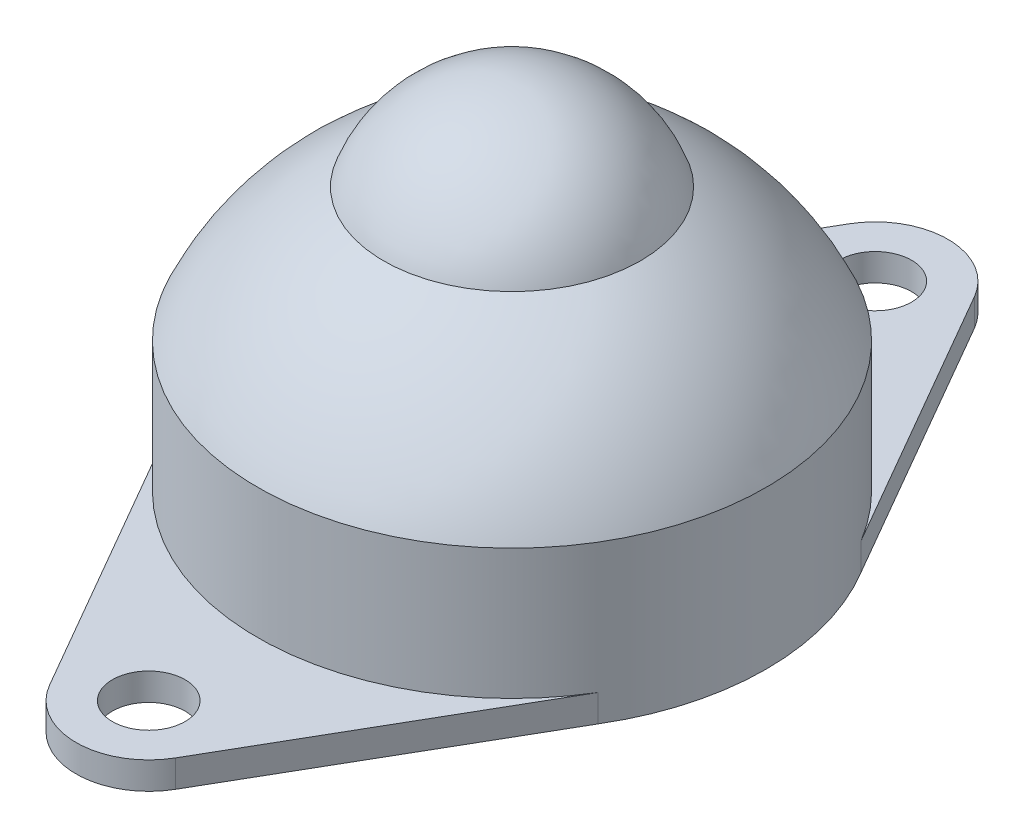
ISO-10303-21;
HEADER;
FILE_DESCRIPTION(('STEP AP214'),'2;1');
FILE_NAME('part.step','',(''),(''),'','','');
FILE_SCHEMA(('AUTOMOTIVE_DESIGN { 1 0 10303 214 1 1 1 1 }'));
ENDSEC;
DATA;
#1=APPLICATION_CONTEXT('core data for automotive mechanical design processes');
#2=APPLICATION_PROTOCOL_DEFINITION('international standard','automotive_design',2000,#1);
#3=PRODUCT_CONTEXT('',#1,'mechanical');
#4=PRODUCT('Part','Part','',(#3));
#5=PRODUCT_RELATED_PRODUCT_CATEGORY('part','',(#4));
#6=PRODUCT_DEFINITION_FORMATION('','',#4);
#7=PRODUCT_DEFINITION_CONTEXT('part definition',#1,'design');
#8=PRODUCT_DEFINITION('design','',#6,#7);
#9=PRODUCT_DEFINITION_SHAPE('','',#8);
#10=(LENGTH_UNIT() NAMED_UNIT(*) SI_UNIT(.MILLI.,.METRE.));
#11=(NAMED_UNIT(*) PLANE_ANGLE_UNIT() SI_UNIT($,.RADIAN.));
#12=(NAMED_UNIT(*) SI_UNIT($,.STERADIAN.) SOLID_ANGLE_UNIT());
#13=UNCERTAINTY_MEASURE_WITH_UNIT(LENGTH_MEASURE(1.E-05),#10,'distance_accuracy_value','');
#14=(GEOMETRIC_REPRESENTATION_CONTEXT(3) GLOBAL_UNCERTAINTY_ASSIGNED_CONTEXT((#13)) GLOBAL_UNIT_ASSIGNED_CONTEXT((#10,
#11,#12)) REPRESENTATION_CONTEXT('',''));
#15=CARTESIAN_POINT('',(0.,0.,0.));
#16=DIRECTION('',(0.,0.,1.));
#17=DIRECTION('',(1.,0.,0.));
#18=AXIS2_PLACEMENT_3D('',#15,#16,#17);
#19=CARTESIAN_POINT('',(0.,0.,0.));
#20=DIRECTION('',(0.,-1.,0.));
#21=DIRECTION('',(0.,0.,-1.));
#22=AXIS2_PLACEMENT_3D('',#19,#20,#21);
#23=CYLINDRICAL_SURFACE('',#22,14.);
#24=CARTESIAN_POINT('',(0.,8.66628605278543,0.));
#25=DIRECTION('',(0.,-1.,0.));
#26=DIRECTION('',(0.,0.,-1.));
#27=AXIS2_PLACEMENT_3D('',#24,#25,#26);
#28=CIRCLE('',#27,14.);
#29=CARTESIAN_POINT('',(0.,8.66628605278543,-14.));
#30=VERTEX_POINT('',#29);
#31=EDGE_CURVE('E184',#30,#30,#28,.T.);
#32=ORIENTED_EDGE('',*,*,#31,.T.);
#33=EDGE_LOOP('',(#32));
#34=FACE_BOUND('',#33,.T.);
#35=CARTESIAN_POINT('',(0.,1.5,0.));
#36=DIRECTION('',(0.,1.,0.));
#37=DIRECTION('',(0.,0.,1.));
#38=AXIS2_PLACEMENT_3D('',#35,#36,#37);
#39=CIRCLE('',#38,14.);
#40=CARTESIAN_POINT('',(-11.9808084921455,1.5,7.24294331570621));
#41=VERTEX_POINT('',#40);
#42=CARTESIAN_POINT('',(11.9808084921456,1.5,7.24294331570617));
#43=VERTEX_POINT('',#42);
#44=EDGE_CURVE('E12',#41,#43,#39,.T.);
#45=ORIENTED_EDGE('',*,*,#44,.T.);
#46=DIRECTION('',(0.,-1.,0.));
#47=VECTOR('',#46,1.);
#48=CARTESIAN_POINT('',(11.9808084921456,1.5,7.24294331570617));
#49=LINE('',#48,#47);
#50=CARTESIAN_POINT('',(11.9808084921456,0.,7.24294331570617));
#51=VERTEX_POINT('',#50);
#52=EDGE_CURVE('E195',#43,#51,#49,.T.);
#53=ORIENTED_EDGE('',*,*,#52,.T.);
#54=CARTESIAN_POINT('',(0.,0.,0.));
#55=DIRECTION('',(0.,-1.,0.));
#56=DIRECTION('',(0.,0.,-1.));
#57=AXIS2_PLACEMENT_3D('',#54,#55,#56);
#58=CIRCLE('',#57,14.);
#59=CARTESIAN_POINT('',(11.9808084921456,0.,-7.24294331570617));
#60=VERTEX_POINT('',#59);
#61=EDGE_CURVE('E178',#60,#51,#58,.T.);
#62=ORIENTED_EDGE('',*,*,#61,.F.);
#63=DIRECTION('',(0.,-1.,0.));
#64=VECTOR('',#63,1.);
#65=CARTESIAN_POINT('',(11.9808084921456,1.5,-7.24294331570617));
#66=LINE('',#65,#64);
#67=CARTESIAN_POINT('',(11.9808084921455,1.5,-7.24294331570621));
#68=VERTEX_POINT('',#67);
#69=EDGE_CURVE('E192',#68,#60,#66,.T.);
#70=ORIENTED_EDGE('',*,*,#69,.F.);
#71=CARTESIAN_POINT('',(-11.9808084921456,1.5,-7.24294331570617));
#72=VERTEX_POINT('',#71);
#73=EDGE_CURVE('E93',#68,#72,#39,.T.);
#74=ORIENTED_EDGE('',*,*,#73,.T.);
#75=DIRECTION('',(0.,-1.,0.));
#76=VECTOR('',#75,1.);
#77=CARTESIAN_POINT('',(-11.9808084921456,1.5,-7.24294331570617));
#78=LINE('',#77,#76);
#79=CARTESIAN_POINT('',(-11.9808084921456,0.,-7.24294331570617));
#80=VERTEX_POINT('',#79);
#81=EDGE_CURVE('E160',#72,#80,#78,.T.);
#82=ORIENTED_EDGE('',*,*,#81,.T.);
#83=CARTESIAN_POINT('',(-11.9808084921455,0.,7.24294331570629));
#84=VERTEX_POINT('',#83);
#85=EDGE_CURVE('E175',#84,#80,#58,.T.);
#86=ORIENTED_EDGE('',*,*,#85,.F.);
#87=DIRECTION('',(0.,-1.,0.));
#88=VECTOR('',#87,1.);
#89=CARTESIAN_POINT('',(-11.9808084921456,1.5,7.24294331570617));
#90=LINE('',#89,#88);
#91=EDGE_CURVE('E103',#41,#84,#90,.T.);
#92=ORIENTED_EDGE('',*,*,#91,.F.);
#93=EDGE_LOOP('',(#45,#53,#62,#70,#74,#82,#86,#92));
#94=FACE_BOUND('',#93,.T.);
#95=ADVANCED_FACE('F89',(#34,#94),#23,.T.);
#96=CARTESIAN_POINT('',(0.,13.5,0.));
#97=DIRECTION('',(0.,-1.,0.));
#98=DIRECTION('',(1.,0.,0.));
#99=AXIS2_PLACEMENT_3D('',#96,#97,#98);
#100=SPHERICAL_SURFACE('',#99,7.5);
#101=CARTESIAN_POINT('',(0.,16.,0.));
#102=DIRECTION('',(0.,-1.,0.));
#103=DIRECTION('',(0.,0.,-1.));
#104=AXIS2_PLACEMENT_3D('',#101,#102,#103);
#105=CIRCLE('',#104,7.07106781186548);
#106=CARTESIAN_POINT('',(0.,16.,-7.07106781186548));
#107=VERTEX_POINT('',#106);
#108=EDGE_CURVE('E186',#107,#107,#105,.T.);
#109=ORIENTED_EDGE('',*,*,#108,.F.);
#110=EDGE_LOOP('',(#109));
#111=FACE_BOUND('',#110,.T.);
#112=ADVANCED_FACE('F91',(#111),#100,.T.);
#113=CARTESIAN_POINT('',(0.,2.37911420478504,0.));
#114=DIRECTION('',(0.,-1.,0.));
#115=DIRECTION('',(-1.,0.,0.));
#116=AXIS2_PLACEMENT_3D('',#113,#114,#115);
#117=SPHERICAL_SURFACE('',#116,15.346938777694);
#118=ORIENTED_EDGE('',*,*,#31,.F.);
#119=EDGE_LOOP('',(#118));
#120=FACE_BOUND('',#119,.T.);
#121=ORIENTED_EDGE('',*,*,#108,.T.);
#122=EDGE_LOOP('',(#121));
#123=FACE_BOUND('',#122,.T.);
#124=ADVANCED_FACE('F246',(#120,#123),#117,.T.);
#125=CARTESIAN_POINT('',(0.,0.,0.));
#126=DIRECTION('',(0.,1.,0.));
#127=DIRECTION('',(0.,0.,1.));
#128=AXIS2_PLACEMENT_3D('',#125,#126,#127);
#129=PLANE('',#128);
#130=ORIENTED_EDGE('',*,*,#61,.T.);
#131=DIRECTION('',(0.499855443895349,0.,-0.866108847205814));
#132=VECTOR('',#131,1.);
#133=CARTESIAN_POINT('',(3.46443538882325,0.,21.9994217755814));
#134=LINE('',#133,#132);
#135=CARTESIAN_POINT('',(3.46443538882325,0.,21.9994217755814));
#136=VERTEX_POINT('',#135);
#137=EDGE_CURVE('E221',#136,#51,#134,.T.);
#138=ORIENTED_EDGE('',*,*,#137,.F.);
#139=CARTESIAN_POINT('',(0.,0.,20.));
#140=DIRECTION('',(0.,-1.,0.));
#141=DIRECTION('',(0.,0.,-1.));
#142=AXIS2_PLACEMENT_3D('',#139,#140,#141);
#143=CIRCLE('',#142,4.);
#144=CARTESIAN_POINT('',(-3.46443538882325,0.,21.9994217755814));
#145=VERTEX_POINT('',#144);
#146=EDGE_CURVE('E218',#136,#145,#143,.T.);
#147=ORIENTED_EDGE('',*,*,#146,.T.);
#148=DIRECTION('',(-0.499855443895349,0.,-0.866108847205814));
#149=VECTOR('',#148,1.);
#150=CARTESIAN_POINT('',(-3.46443538882325,0.,21.9994217755814));
#151=LINE('',#150,#149);
#152=EDGE_CURVE('E210',#145,#84,#151,.T.);
#153=ORIENTED_EDGE('',*,*,#152,.T.);
#154=ORIENTED_EDGE('',*,*,#85,.T.);
#155=DIRECTION('',(-0.499855443895349,0.,0.866108847205814));
#156=VECTOR('',#155,1.);
#157=CARTESIAN_POINT('',(-3.46443538882325,0.,-21.9994217755814));
#158=LINE('',#157,#156);
#159=CARTESIAN_POINT('',(-3.46443538882325,0.,-21.9994217755814));
#160=VERTEX_POINT('',#159);
#161=EDGE_CURVE('E219',#160,#80,#158,.T.);
#162=ORIENTED_EDGE('',*,*,#161,.F.);
#163=CARTESIAN_POINT('',(0.,0.,-20.));
#164=DIRECTION('',(0.,1.,0.));
#165=DIRECTION('',(0.,0.,1.));
#166=AXIS2_PLACEMENT_3D('',#163,#164,#165);
#167=CIRCLE('',#166,4.);
#168=CARTESIAN_POINT('',(3.46443538882325,0.,-21.9994217755814));
#169=VERTEX_POINT('',#168);
#170=EDGE_CURVE('E174',#169,#160,#167,.T.);
#171=ORIENTED_EDGE('',*,*,#170,.F.);
#172=DIRECTION('',(0.499855443895349,0.,0.866108847205814));
#173=VECTOR('',#172,1.);
#174=CARTESIAN_POINT('',(3.46443538882325,0.,-21.9994217755814));
#175=LINE('',#174,#173);
#176=EDGE_CURVE('E170',#169,#60,#175,.T.);
#177=ORIENTED_EDGE('',*,*,#176,.T.);
#178=EDGE_LOOP('',(#130,#138,#147,#153,#154,#162,#171,#177));
#179=FACE_BOUND('',#178,.T.);
#180=CARTESIAN_POINT('',(0.,0.,20.));
#181=DIRECTION('',(0.,-1.,0.));
#182=DIRECTION('',(0.,0.,-1.));
#183=AXIS2_PLACEMENT_3D('',#180,#181,#182);
#184=CIRCLE('',#183,2.);
#185=CARTESIAN_POINT('',(0.,0.,18.));
#186=VERTEX_POINT('',#185);
#187=EDGE_CURVE('E342',#186,#186,#184,.T.);
#188=ORIENTED_EDGE('',*,*,#187,.F.);
#189=EDGE_LOOP('',(#188));
#190=FACE_BOUND('',#189,.T.);
#191=CARTESIAN_POINT('',(0.,0.,-20.));
#192=DIRECTION('',(0.,1.,0.));
#193=DIRECTION('',(0.,0.,1.));
#194=AXIS2_PLACEMENT_3D('',#191,#192,#193);
#195=CIRCLE('',#194,2.);
#196=CARTESIAN_POINT('',(0.,0.,-18.));
#197=VERTEX_POINT('',#196);
#198=EDGE_CURVE('E344',#197,#197,#195,.T.);
#199=ORIENTED_EDGE('',*,*,#198,.T.);
#200=EDGE_LOOP('',(#199));
#201=FACE_BOUND('',#200,.T.);
#202=ADVANCED_FACE('F214',(#179,#190,#201),#129,.F.);
#203=CARTESIAN_POINT('',(0.,1.5,-20.));
#204=DIRECTION('',(0.,-1.,0.));
#205=DIRECTION('',(0.,0.,-1.));
#206=AXIS2_PLACEMENT_3D('',#203,#204,#205);
#207=CYLINDRICAL_SURFACE('',#206,2.);
#208=CARTESIAN_POINT('',(0.,1.5,-20.));
#209=DIRECTION('',(0.,1.,0.));
#210=DIRECTION('',(0.,0.,1.));
#211=AXIS2_PLACEMENT_3D('',#208,#209,#210);
#212=CIRCLE('',#211,2.);
#213=CARTESIAN_POINT('',(0.,1.5,-18.));
#214=VERTEX_POINT('',#213);
#215=EDGE_CURVE('E347',#214,#214,#212,.T.);
#216=ORIENTED_EDGE('',*,*,#215,.T.);
#217=EDGE_LOOP('',(#216));
#218=FACE_BOUND('',#217,.T.);
#219=ORIENTED_EDGE('',*,*,#198,.F.);
#220=EDGE_LOOP('',(#219));
#221=FACE_BOUND('',#220,.T.);
#222=ADVANCED_FACE('F229',(#218,#221),#207,.F.);
#223=CARTESIAN_POINT('',(3.46443538882325,1.5,-21.9994217755814));
#224=DIRECTION('',(0.866108847205814,0.,-0.499855443895349));
#225=DIRECTION('',(-0.499855443895349,0.,-0.866108847205814));
#226=AXIS2_PLACEMENT_3D('',#223,#224,#225);
#227=PLANE('',#226);
#228=ORIENTED_EDGE('',*,*,#176,.F.);
#229=DIRECTION('',(0.,-1.,0.));
#230=VECTOR('',#229,1.);
#231=CARTESIAN_POINT('',(3.46443538882325,1.5,-21.9994217755814));
#232=LINE('',#231,#230);
#233=CARTESIAN_POINT('',(3.46443538882325,1.5,-21.9994217755814));
#234=VERTEX_POINT('',#233);
#235=EDGE_CURVE('E196',#234,#169,#232,.T.);
#236=ORIENTED_EDGE('',*,*,#235,.F.);
#237=DIRECTION('',(0.499855443895349,0.,0.866108847205814));
#238=VECTOR('',#237,1.);
#239=CARTESIAN_POINT('',(3.46443538882325,1.5,-21.9994217755814));
#240=LINE('',#239,#238);
#241=EDGE_CURVE('E111',#234,#68,#240,.T.);
#242=ORIENTED_EDGE('',*,*,#241,.T.);
#243=ORIENTED_EDGE('',*,*,#69,.T.);
#244=EDGE_LOOP('',(#228,#236,#242,#243));
#245=FACE_BOUND('',#244,.T.);
#246=ADVANCED_FACE('F227',(#245),#227,.T.);
#247=CARTESIAN_POINT('',(-3.46443538882325,1.5,-21.9994217755814));
#248=DIRECTION('',(0.866108847205814,0.,0.499855443895349));
#249=DIRECTION('',(0.499855443895349,0.,-0.866108847205814));
#250=AXIS2_PLACEMENT_3D('',#247,#248,#249);
#251=PLANE('',#250);
#252=ORIENTED_EDGE('',*,*,#161,.T.);
#253=ORIENTED_EDGE('',*,*,#81,.F.);
#254=DIRECTION('',(-0.499855443895349,0.,0.866108847205814));
#255=VECTOR('',#254,1.);
#256=CARTESIAN_POINT('',(-3.46443538882325,1.5,-21.9994217755814));
#257=LINE('',#256,#255);
#258=CARTESIAN_POINT('',(-3.46443538882325,1.5,-21.9994217755814));
#259=VERTEX_POINT('',#258);
#260=EDGE_CURVE('E153',#259,#72,#257,.T.);
#261=ORIENTED_EDGE('',*,*,#260,.F.);
#262=DIRECTION('',(0.,-1.,0.));
#263=VECTOR('',#262,1.);
#264=CARTESIAN_POINT('',(-3.46443538882325,1.5,-21.9994217755814));
#265=LINE('',#264,#263);
#266=EDGE_CURVE('E157',#259,#160,#265,.T.);
#267=ORIENTED_EDGE('',*,*,#266,.T.);
#268=EDGE_LOOP('',(#252,#253,#261,#267));
#269=FACE_BOUND('',#268,.T.);
#270=ADVANCED_FACE('F155',(#269),#251,.F.);
#271=CARTESIAN_POINT('',(0.,1.5,-20.));
#272=DIRECTION('',(0.,-1.,0.));
#273=DIRECTION('',(0.,0.,-1.));
#274=AXIS2_PLACEMENT_3D('',#271,#272,#273);
#275=CYLINDRICAL_SURFACE('',#274,4.);
#276=ORIENTED_EDGE('',*,*,#170,.T.);
#277=ORIENTED_EDGE('',*,*,#266,.F.);
#278=CARTESIAN_POINT('',(0.,1.5,-20.));
#279=DIRECTION('',(0.,1.,0.));
#280=DIRECTION('',(0.,0.,1.));
#281=AXIS2_PLACEMENT_3D('',#278,#279,#280);
#282=CIRCLE('',#281,4.);
#283=EDGE_CURVE('E164',#234,#259,#282,.T.);
#284=ORIENTED_EDGE('',*,*,#283,.F.);
#285=ORIENTED_EDGE('',*,*,#235,.T.);
#286=EDGE_LOOP('',(#276,#277,#284,#285));
#287=FACE_BOUND('',#286,.T.);
#288=ADVANCED_FACE('F172',(#287),#275,.T.);
#289=CARTESIAN_POINT('',(0.,1.5,-20.));
#290=DIRECTION('',(0.,1.,0.));
#291=DIRECTION('',(0.,0.,1.));
#292=AXIS2_PLACEMENT_3D('',#289,#290,#291);
#293=PLANE('',#292);
#294=ORIENTED_EDGE('',*,*,#73,.F.);
#295=ORIENTED_EDGE('',*,*,#241,.F.);
#296=ORIENTED_EDGE('',*,*,#283,.T.);
#297=ORIENTED_EDGE('',*,*,#260,.T.);
#298=EDGE_LOOP('',(#294,#295,#296,#297));
#299=FACE_BOUND('',#298,.T.);
#300=ORIENTED_EDGE('',*,*,#215,.F.);
#301=EDGE_LOOP('',(#300));
#302=FACE_BOUND('',#301,.T.);
#303=ADVANCED_FACE('F167',(#299,#302),#293,.T.);
#304=ORIENTED_EDGE('',*,*,#44,.F.);
#305=DIRECTION('',(-0.499855443895349,0.,-0.866108847205814));
#306=VECTOR('',#305,1.);
#307=CARTESIAN_POINT('',(-3.46443538882325,1.5,21.9994217755814));
#308=LINE('',#307,#306);
#309=CARTESIAN_POINT('',(-3.46443538882325,1.5,21.9994217755814));
#310=VERTEX_POINT('',#309);
#311=EDGE_CURVE('E163',#310,#41,#308,.T.);
#312=ORIENTED_EDGE('',*,*,#311,.F.);
#313=CARTESIAN_POINT('',(0.,1.5,20.));
#314=DIRECTION('',(0.,-1.,0.));
#315=DIRECTION('',(0.,0.,-1.));
#316=AXIS2_PLACEMENT_3D('',#313,#314,#315);
#317=CIRCLE('',#316,4.);
#318=CARTESIAN_POINT('',(3.46443538882325,1.5,21.9994217755814));
#319=VERTEX_POINT('',#318);
#320=EDGE_CURVE('E353',#319,#310,#317,.T.);
#321=ORIENTED_EDGE('',*,*,#320,.F.);
#322=DIRECTION('',(0.499855443895349,0.,-0.866108847205814));
#323=VECTOR('',#322,1.);
#324=CARTESIAN_POINT('',(3.46443538882325,1.5,21.9994217755814));
#325=LINE('',#324,#323);
#326=EDGE_CURVE('E356',#319,#43,#325,.T.);
#327=ORIENTED_EDGE('',*,*,#326,.T.);
#328=EDGE_LOOP('',(#304,#312,#321,#327));
#329=FACE_BOUND('',#328,.T.);
#330=CARTESIAN_POINT('',(0.,1.5,20.));
#331=DIRECTION('',(0.,-1.,0.));
#332=DIRECTION('',(0.,0.,-1.));
#333=AXIS2_PLACEMENT_3D('',#330,#331,#332);
#334=CIRCLE('',#333,2.);
#335=CARTESIAN_POINT('',(0.,1.5,18.));
#336=VERTEX_POINT('',#335);
#337=EDGE_CURVE('E339',#336,#336,#334,.T.);
#338=ORIENTED_EDGE('',*,*,#337,.T.);
#339=EDGE_LOOP('',(#338));
#340=FACE_BOUND('',#339,.T.);
#341=ADVANCED_FACE('F288',(#329,#340),#293,.T.);
#342=CARTESIAN_POINT('',(-3.46443538882325,1.5,21.9994217755814));
#343=DIRECTION('',(-0.866108847205814,0.,0.499855443895349));
#344=DIRECTION('',(0.499855443895349,0.,0.866108847205814));
#345=AXIS2_PLACEMENT_3D('',#342,#343,#344);
#346=PLANE('',#345);
#347=ORIENTED_EDGE('',*,*,#152,.F.);
#348=DIRECTION('',(0.,-1.,0.));
#349=VECTOR('',#348,1.);
#350=CARTESIAN_POINT('',(-3.46443538882325,1.5,21.9994217755814));
#351=LINE('',#350,#349);
#352=EDGE_CURVE('E204',#310,#145,#351,.T.);
#353=ORIENTED_EDGE('',*,*,#352,.F.);
#354=ORIENTED_EDGE('',*,*,#311,.T.);
#355=ORIENTED_EDGE('',*,*,#91,.T.);
#356=EDGE_LOOP('',(#347,#353,#354,#355));
#357=FACE_BOUND('',#356,.T.);
#358=ADVANCED_FACE('F209',(#357),#346,.T.);
#359=CARTESIAN_POINT('',(0.,1.5,20.));
#360=DIRECTION('',(0.,-1.,0.));
#361=DIRECTION('',(0.,0.,-1.));
#362=AXIS2_PLACEMENT_3D('',#359,#360,#361);
#363=CYLINDRICAL_SURFACE('',#362,4.);
#364=ORIENTED_EDGE('',*,*,#146,.F.);
#365=DIRECTION('',(0.,-1.,0.));
#366=VECTOR('',#365,1.);
#367=CARTESIAN_POINT('',(3.46443538882325,1.5,21.9994217755814));
#368=LINE('',#367,#366);
#369=EDGE_CURVE('E198',#319,#136,#368,.T.);
#370=ORIENTED_EDGE('',*,*,#369,.F.);
#371=ORIENTED_EDGE('',*,*,#320,.T.);
#372=ORIENTED_EDGE('',*,*,#352,.T.);
#373=EDGE_LOOP('',(#364,#370,#371,#372));
#374=FACE_BOUND('',#373,.T.);
#375=ADVANCED_FACE('F304',(#374),#363,.T.);
#376=CARTESIAN_POINT('',(3.46443538882325,1.5,21.9994217755814));
#377=DIRECTION('',(-0.866108847205814,0.,-0.499855443895349));
#378=DIRECTION('',(-0.499855443895349,0.,0.866108847205814));
#379=AXIS2_PLACEMENT_3D('',#376,#377,#378);
#380=PLANE('',#379);
#381=ORIENTED_EDGE('',*,*,#137,.T.);
#382=ORIENTED_EDGE('',*,*,#52,.F.);
#383=ORIENTED_EDGE('',*,*,#326,.F.);
#384=ORIENTED_EDGE('',*,*,#369,.T.);
#385=EDGE_LOOP('',(#381,#382,#383,#384));
#386=FACE_BOUND('',#385,.T.);
#387=ADVANCED_FACE('F313',(#386),#380,.F.);
#388=CARTESIAN_POINT('',(0.,1.5,20.));
#389=DIRECTION('',(0.,-1.,0.));
#390=DIRECTION('',(0.,0.,-1.));
#391=AXIS2_PLACEMENT_3D('',#388,#389,#390);
#392=CYLINDRICAL_SURFACE('',#391,2.);
#393=ORIENTED_EDGE('',*,*,#337,.F.);
#394=EDGE_LOOP('',(#393));
#395=FACE_BOUND('',#394,.T.);
#396=ORIENTED_EDGE('',*,*,#187,.T.);
#397=EDGE_LOOP('',(#396));
#398=FACE_BOUND('',#397,.T.);
#399=ADVANCED_FACE('F323',(#395,#398),#392,.F.);
#400=CLOSED_SHELL('',(#95,#112,#124,#202,#222,#246,#270,#288,#303,#341,#358,#375,#387,#399));
#401=MANIFOLD_SOLID_BREP('B2',#400);
#402=ADVANCED_BREP_SHAPE_REPRESENTATION('',(#18,#401),#14);
#403=SHAPE_DEFINITION_REPRESENTATION(#9,#402);
ENDSEC;
END-ISO-10303-21;
